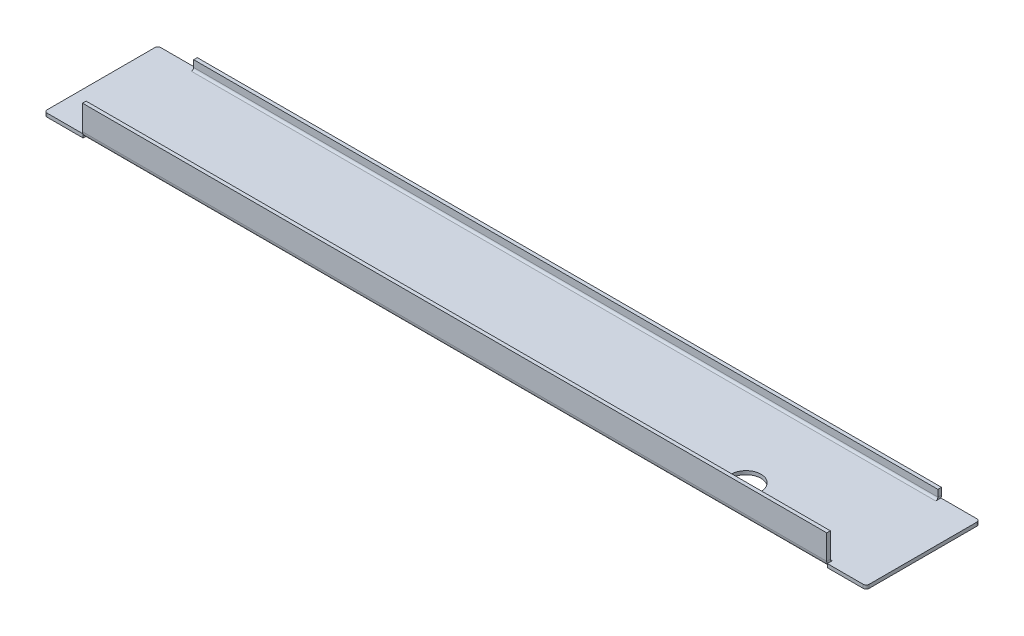
ISO-10303-21;
HEADER;
FILE_DESCRIPTION(('STEP AP214'),'2;1');
FILE_NAME('part.step','',(''),(''),'','','');
FILE_SCHEMA(('AUTOMOTIVE_DESIGN { 1 0 10303 214 1 1 1 1 }'));
ENDSEC;
DATA;
#1=APPLICATION_CONTEXT('core data for automotive mechanical design processes');
#2=APPLICATION_PROTOCOL_DEFINITION('international standard','automotive_design',2000,#1);
#3=PRODUCT_CONTEXT('',#1,'mechanical');
#4=PRODUCT('Part','Part','',(#3));
#5=PRODUCT_RELATED_PRODUCT_CATEGORY('part','',(#4));
#6=PRODUCT_DEFINITION_FORMATION('','',#4);
#7=PRODUCT_DEFINITION_CONTEXT('part definition',#1,'design');
#8=PRODUCT_DEFINITION('design','',#6,#7);
#9=PRODUCT_DEFINITION_SHAPE('','',#8);
#10=(LENGTH_UNIT() NAMED_UNIT(*) SI_UNIT(.MILLI.,.METRE.));
#11=(NAMED_UNIT(*) PLANE_ANGLE_UNIT() SI_UNIT($,.RADIAN.));
#12=(NAMED_UNIT(*) SI_UNIT($,.STERADIAN.) SOLID_ANGLE_UNIT());
#13=UNCERTAINTY_MEASURE_WITH_UNIT(LENGTH_MEASURE(1.E-05),#10,'distance_accuracy_value','');
#14=(GEOMETRIC_REPRESENTATION_CONTEXT(3) GLOBAL_UNCERTAINTY_ASSIGNED_CONTEXT((#13)) GLOBAL_UNIT_ASSIGNED_CONTEXT((#10,
#11,#12)) REPRESENTATION_CONTEXT('',''));
#15=CARTESIAN_POINT('',(0.,0.,0.));
#16=DIRECTION('',(0.,0.,1.));
#17=DIRECTION('',(1.,0.,0.));
#18=AXIS2_PLACEMENT_3D('',#15,#16,#17);
#19=CARTESIAN_POINT('',(-124.5,0.7366,17.2634));
#20=DIRECTION('',(-1.,0.,0.));
#21=DIRECTION('',(0.,0.,1.));
#22=AXIS2_PLACEMENT_3D('',#19,#20,#21);
#23=PLANE('',#22);
#24=CARTESIAN_POINT('',(-124.5,0.7366,17.2634));
#25=DIRECTION('',(1.,0.,0.));
#26=DIRECTION('',(0.,0.,-1.));
#27=AXIS2_PLACEMENT_3D('',#24,#25,#26);
#28=CIRCLE('',#27,0.7366);
#29=CARTESIAN_POINT('',(-124.5,0.7366,18.));
#30=VERTEX_POINT('',#29);
#31=CARTESIAN_POINT('',(-124.5,0.,17.2634));
#32=VERTEX_POINT('',#31);
#33=EDGE_CURVE('E301',#30,#32,#28,.T.);
#34=ORIENTED_EDGE('',*,*,#33,.T.);
#35=DIRECTION('',(0.,0.,-1.));
#36=VECTOR('',#35,1.);
#37=CARTESIAN_POINT('',(-124.5,0.,19.));
#38=LINE('',#37,#36);
#39=CARTESIAN_POINT('',(-124.5,0.,19.));
#40=VERTEX_POINT('',#39);
#41=EDGE_CURVE('E239',#40,#32,#38,.T.);
#42=ORIENTED_EDGE('',*,*,#41,.F.);
#43=DIRECTION('',(0.,1.,0.));
#44=VECTOR('',#43,1.);
#45=CARTESIAN_POINT('',(-124.5,-1.2,19.));
#46=LINE('',#45,#44);
#47=CARTESIAN_POINT('',(-124.5,-0.120511427995214,19.));
#48=VERTEX_POINT('',#47);
#49=EDGE_CURVE('E218',#48,#40,#46,.T.);
#50=ORIENTED_EDGE('',*,*,#49,.F.);
#51=CARTESIAN_POINT('',(-124.5,0.7366,17.2634));
#52=DIRECTION('',(-1.,0.,0.));
#53=DIRECTION('',(0.,0.,1.));
#54=AXIS2_PLACEMENT_3D('',#51,#52,#53);
#55=CIRCLE('',#54,1.9366);
#56=CARTESIAN_POINT('',(-124.5,0.736600000000001,19.2));
#57=VERTEX_POINT('',#56);
#58=EDGE_CURVE('E304',#57,#48,#55,.F.);
#59=ORIENTED_EDGE('',*,*,#58,.F.);
#60=DIRECTION('',(0.,0.,-1.));
#61=VECTOR('',#60,1.);
#62=CARTESIAN_POINT('',(-124.5,0.7366,18.));
#63=LINE('',#62,#61);
#64=EDGE_CURVE('E314',#30,#57,#63,.F.);
#65=ORIENTED_EDGE('',*,*,#64,.F.);
#66=EDGE_LOOP('',(#34,#42,#50,#59,#65));
#67=FACE_BOUND('',#66,.T.);
#68=ADVANCED_FACE('F34',(#67),#23,.T.);
#69=CARTESIAN_POINT('',(-124.5,0.7366,-17.2634));
#70=DIRECTION('',(-1.,0.,0.));
#71=DIRECTION('',(0.,0.,1.));
#72=AXIS2_PLACEMENT_3D('',#69,#70,#71);
#73=PLANE('',#72);
#74=DIRECTION('',(0.,1.,0.));
#75=VECTOR('',#74,1.);
#76=CARTESIAN_POINT('',(-124.5,0.7366,-19.));
#77=LINE('',#76,#75);
#78=CARTESIAN_POINT('',(-124.5,-0.120511427995214,-19.));
#79=VERTEX_POINT('',#78);
#80=CARTESIAN_POINT('',(-124.5,0.,-19.));
#81=VERTEX_POINT('',#80);
#82=EDGE_CURVE('E380',#79,#81,#77,.T.);
#83=ORIENTED_EDGE('',*,*,#82,.T.);
#84=DIRECTION('',(0.,0.,1.));
#85=VECTOR('',#84,1.);
#86=CARTESIAN_POINT('',(-124.5,0.,-17.2634));
#87=LINE('',#86,#85);
#88=CARTESIAN_POINT('',(-124.5,0.,-17.2634));
#89=VERTEX_POINT('',#88);
#90=EDGE_CURVE('E383',#81,#89,#87,.T.);
#91=ORIENTED_EDGE('',*,*,#90,.T.);
#92=CARTESIAN_POINT('',(-124.5,0.7366,-17.2634));
#93=DIRECTION('',(1.,0.,0.));
#94=DIRECTION('',(0.,0.,-1.));
#95=AXIS2_PLACEMENT_3D('',#92,#93,#94);
#96=CIRCLE('',#95,0.7366);
#97=CARTESIAN_POINT('',(-124.5,0.7366,-18.));
#98=VERTEX_POINT('',#97);
#99=EDGE_CURVE('E283',#89,#98,#96,.T.);
#100=ORIENTED_EDGE('',*,*,#99,.T.);
#101=DIRECTION('',(0.,0.,1.));
#102=VECTOR('',#101,1.);
#103=CARTESIAN_POINT('',(-124.5,0.7366,-18.));
#104=LINE('',#103,#102);
#105=CARTESIAN_POINT('',(-124.5,0.736599999999998,-19.2));
#106=VERTEX_POINT('',#105);
#107=EDGE_CURVE('E295',#98,#106,#104,.F.);
#108=ORIENTED_EDGE('',*,*,#107,.T.);
#109=CARTESIAN_POINT('',(-124.5,0.7366,-17.2634));
#110=DIRECTION('',(-1.,0.,0.));
#111=DIRECTION('',(0.,0.,1.));
#112=AXIS2_PLACEMENT_3D('',#109,#110,#111);
#113=CIRCLE('',#112,1.9366);
#114=EDGE_CURVE('E289',#79,#106,#113,.F.);
#115=ORIENTED_EDGE('',*,*,#114,.F.);
#116=EDGE_LOOP('',(#83,#91,#100,#108,#115));
#117=FACE_BOUND('',#116,.T.);
#118=ADVANCED_FACE('F437',(#117),#73,.T.);
#119=CARTESIAN_POINT('',(124.5,0.7366,17.2634));
#120=DIRECTION('',(1.,0.,0.));
#121=DIRECTION('',(0.,0.,-1.));
#122=AXIS2_PLACEMENT_3D('',#119,#120,#121);
#123=PLANE('',#122);
#124=DIRECTION('',(0.,-1.,0.));
#125=VECTOR('',#124,1.);
#126=CARTESIAN_POINT('',(124.5,0.,19.));
#127=LINE('',#126,#125);
#128=CARTESIAN_POINT('',(124.5,0.,19.));
#129=VERTEX_POINT('',#128);
#130=CARTESIAN_POINT('',(124.5,-0.120511427995214,19.));
#131=VERTEX_POINT('',#130);
#132=EDGE_CURVE('E250',#129,#131,#127,.T.);
#133=ORIENTED_EDGE('',*,*,#132,.F.);
#134=DIRECTION('',(0.,0.,-1.));
#135=VECTOR('',#134,1.);
#136=CARTESIAN_POINT('',(124.5,0.,19.));
#137=LINE('',#136,#135);
#138=CARTESIAN_POINT('',(124.5,0.,17.2634));
#139=VERTEX_POINT('',#138);
#140=EDGE_CURVE('E263',#129,#139,#137,.T.);
#141=ORIENTED_EDGE('',*,*,#140,.T.);
#142=CARTESIAN_POINT('',(124.5,0.7366,17.2634));
#143=DIRECTION('',(-1.,0.,0.));
#144=DIRECTION('',(0.,0.,1.));
#145=AXIS2_PLACEMENT_3D('',#142,#143,#144);
#146=CIRCLE('',#145,0.7366);
#147=CARTESIAN_POINT('',(124.5,0.7366,18.));
#148=VERTEX_POINT('',#147);
#149=EDGE_CURVE('E320',#139,#148,#146,.T.);
#150=ORIENTED_EDGE('',*,*,#149,.T.);
#151=DIRECTION('',(0.,0.,1.));
#152=VECTOR('',#151,1.);
#153=CARTESIAN_POINT('',(124.5,0.7366,19.2));
#154=LINE('',#153,#152);
#155=CARTESIAN_POINT('',(124.5,0.7366,19.2));
#156=VERTEX_POINT('',#155);
#157=EDGE_CURVE('E329',#156,#148,#154,.F.);
#158=ORIENTED_EDGE('',*,*,#157,.F.);
#159=CARTESIAN_POINT('',(124.5,0.7366,17.2634));
#160=DIRECTION('',(-1.,0.,0.));
#161=DIRECTION('',(0.,0.,1.));
#162=AXIS2_PLACEMENT_3D('',#159,#160,#161);
#163=CIRCLE('',#162,1.9366);
#164=EDGE_CURVE('E317',#131,#156,#163,.T.);
#165=ORIENTED_EDGE('',*,*,#164,.F.);
#166=EDGE_LOOP('',(#133,#141,#150,#158,#165));
#167=FACE_BOUND('',#166,.T.);
#168=ADVANCED_FACE('F443',(#167),#123,.T.);
#169=CARTESIAN_POINT('',(124.5,0.7366,-17.2634));
#170=DIRECTION('',(1.,0.,0.));
#171=DIRECTION('',(0.,0.,-1.));
#172=AXIS2_PLACEMENT_3D('',#169,#170,#171);
#173=PLANE('',#172);
#174=CARTESIAN_POINT('',(124.5,0.7366,-17.2634));
#175=DIRECTION('',(-1.,0.,0.));
#176=DIRECTION('',(0.,0.,1.));
#177=AXIS2_PLACEMENT_3D('',#174,#175,#176);
#178=CIRCLE('',#177,0.7366);
#179=CARTESIAN_POINT('',(124.5,0.736599999999999,-18.));
#180=VERTEX_POINT('',#179);
#181=CARTESIAN_POINT('',(124.5,0.,-17.2634));
#182=VERTEX_POINT('',#181);
#183=EDGE_CURVE('E269',#180,#182,#178,.T.);
#184=ORIENTED_EDGE('',*,*,#183,.T.);
#185=CARTESIAN_POINT('',(124.5,0.,-19.));
#186=VERTEX_POINT('',#185);
#187=EDGE_CURVE('E262',#182,#186,#137,.T.);
#188=ORIENTED_EDGE('',*,*,#187,.T.);
#189=DIRECTION('',(0.,-1.,0.));
#190=VECTOR('',#189,1.);
#191=CARTESIAN_POINT('',(124.5,0.,-19.));
#192=LINE('',#191,#190);
#193=CARTESIAN_POINT('',(124.5,-0.120511427995214,-19.));
#194=VERTEX_POINT('',#193);
#195=EDGE_CURVE('E247',#186,#194,#192,.T.);
#196=ORIENTED_EDGE('',*,*,#195,.T.);
#197=CARTESIAN_POINT('',(124.5,0.7366,-17.2634));
#198=DIRECTION('',(-1.,0.,0.));
#199=DIRECTION('',(0.,0.,1.));
#200=AXIS2_PLACEMENT_3D('',#197,#198,#199);
#201=CIRCLE('',#200,1.9366);
#202=CARTESIAN_POINT('',(124.5,0.736599999999998,-19.2));
#203=VERTEX_POINT('',#202);
#204=EDGE_CURVE('E268',#203,#194,#201,.T.);
#205=ORIENTED_EDGE('',*,*,#204,.F.);
#206=DIRECTION('',(0.,0.,-1.));
#207=VECTOR('',#206,1.);
#208=CARTESIAN_POINT('',(124.5,0.736599999999998,-19.2));
#209=LINE('',#208,#207);
#210=EDGE_CURVE('E280',#203,#180,#209,.F.);
#211=ORIENTED_EDGE('',*,*,#210,.T.);
#212=EDGE_LOOP('',(#184,#188,#196,#205,#211));
#213=FACE_BOUND('',#212,.T.);
#214=ADVANCED_FACE('F456',(#213),#173,.T.);
#215=CARTESIAN_POINT('',(137.5,0.,-19.2));
#216=DIRECTION('',(0.,0.,1.));
#217=DIRECTION('',(0.,-1.,0.));
#218=AXIS2_PLACEMENT_3D('',#215,#216,#217);
#219=PLANE('',#218);
#220=DIRECTION('',(0.,-1.,0.));
#221=VECTOR('',#220,1.);
#222=CARTESIAN_POINT('',(124.5,0.,-19.2));
#223=LINE('',#222,#221);
#224=CARTESIAN_POINT('',(124.5,3.,-19.2));
#225=VERTEX_POINT('',#224);
#226=EDGE_CURVE('E272',#225,#203,#223,.T.);
#227=ORIENTED_EDGE('',*,*,#226,.T.);
#228=DIRECTION('',(-1.,0.,0.));
#229=VECTOR('',#228,1.);
#230=CARTESIAN_POINT('',(137.5,0.736599999999998,-19.2));
#231=LINE('',#230,#229);
#232=EDGE_CURVE('E345',#203,#106,#231,.T.);
#233=ORIENTED_EDGE('',*,*,#232,.T.);
#234=DIRECTION('',(0.,-1.,0.));
#235=VECTOR('',#234,1.);
#236=CARTESIAN_POINT('',(-124.5,0.,-19.2));
#237=LINE('',#236,#235);
#238=CARTESIAN_POINT('',(-124.5,3.,-19.2));
#239=VERTEX_POINT('',#238);
#240=EDGE_CURVE('E292',#106,#239,#237,.F.);
#241=ORIENTED_EDGE('',*,*,#240,.T.);
#242=DIRECTION('',(-1.,0.,0.));
#243=VECTOR('',#242,1.);
#244=CARTESIAN_POINT('',(137.5,3.,-19.2));
#245=LINE('',#244,#243);
#246=EDGE_CURVE('E378',#225,#239,#245,.T.);
#247=ORIENTED_EDGE('',*,*,#246,.F.);
#248=EDGE_LOOP('',(#227,#233,#241,#247));
#249=FACE_BOUND('',#248,.T.);
#250=ADVANCED_FACE('F503',(#249),#219,.F.);
#251=CARTESIAN_POINT('',(137.5,3.,-18.));
#252=DIRECTION('',(0.,1.,0.));
#253=DIRECTION('',(0.,0.,1.));
#254=AXIS2_PLACEMENT_3D('',#251,#252,#253);
#255=PLANE('',#254);
#256=DIRECTION('',(-1.,0.,0.));
#257=VECTOR('',#256,1.);
#258=CARTESIAN_POINT('',(137.5,3.,-18.));
#259=LINE('',#258,#257);
#260=CARTESIAN_POINT('',(124.5,3.,-18.));
#261=VERTEX_POINT('',#260);
#262=CARTESIAN_POINT('',(-124.5,3.,-18.));
#263=VERTEX_POINT('',#262);
#264=EDGE_CURVE('E376',#261,#263,#259,.T.);
#265=ORIENTED_EDGE('',*,*,#264,.F.);
#266=DIRECTION('',(0.,0.,-1.));
#267=VECTOR('',#266,1.);
#268=CARTESIAN_POINT('',(124.5,3.,-19.2));
#269=LINE('',#268,#267);
#270=EDGE_CURVE('E277',#225,#261,#269,.F.);
#271=ORIENTED_EDGE('',*,*,#270,.F.);
#272=ORIENTED_EDGE('',*,*,#246,.T.);
#273=DIRECTION('',(0.,0.,1.));
#274=VECTOR('',#273,1.);
#275=CARTESIAN_POINT('',(-124.5,3.,-18.));
#276=LINE('',#275,#274);
#277=EDGE_CURVE('E298',#263,#239,#276,.F.);
#278=ORIENTED_EDGE('',*,*,#277,.F.);
#279=EDGE_LOOP('',(#265,#271,#272,#278));
#280=FACE_BOUND('',#279,.T.);
#281=ADVANCED_FACE('F499',(#280),#255,.T.);
#282=CARTESIAN_POINT('',(137.5,0.,-18.));
#283=DIRECTION('',(0.,0.,1.));
#284=DIRECTION('',(0.,-1.,0.));
#285=AXIS2_PLACEMENT_3D('',#282,#283,#284);
#286=PLANE('',#285);
#287=DIRECTION('',(-1.,0.,0.));
#288=VECTOR('',#287,1.);
#289=CARTESIAN_POINT('',(137.5,0.736599999999999,-18.));
#290=LINE('',#289,#288);
#291=EDGE_CURVE('E374',#180,#98,#290,.T.);
#292=ORIENTED_EDGE('',*,*,#291,.F.);
#293=DIRECTION('',(0.,-1.,0.));
#294=VECTOR('',#293,1.);
#295=CARTESIAN_POINT('',(124.5,0.,-18.));
#296=LINE('',#295,#294);
#297=EDGE_CURVE('E275',#261,#180,#296,.T.);
#298=ORIENTED_EDGE('',*,*,#297,.F.);
#299=ORIENTED_EDGE('',*,*,#264,.T.);
#300=DIRECTION('',(0.,1.,0.));
#301=VECTOR('',#300,1.);
#302=CARTESIAN_POINT('',(-124.5,0.,-18.));
#303=LINE('',#302,#301);
#304=EDGE_CURVE('E288',#98,#263,#303,.T.);
#305=ORIENTED_EDGE('',*,*,#304,.F.);
#306=EDGE_LOOP('',(#292,#298,#299,#305));
#307=FACE_BOUND('',#306,.T.);
#308=ADVANCED_FACE('F495',(#307),#286,.T.);
#309=CARTESIAN_POINT('',(137.5,0.7366,-17.2634));
#310=DIRECTION('',(-1.,0.,0.));
#311=DIRECTION('',(0.,0.,1.));
#312=AXIS2_PLACEMENT_3D('',#309,#310,#311);
#313=CYLINDRICAL_SURFACE('',#312,0.7366);
#314=DIRECTION('',(-1.,0.,0.));
#315=VECTOR('',#314,1.);
#316=CARTESIAN_POINT('',(137.5,0.,-17.2634));
#317=LINE('',#316,#315);
#318=EDGE_CURVE('E371',#182,#89,#317,.T.);
#319=ORIENTED_EDGE('',*,*,#318,.F.);
#320=ORIENTED_EDGE('',*,*,#183,.F.);
#321=ORIENTED_EDGE('',*,*,#291,.T.);
#322=ORIENTED_EDGE('',*,*,#99,.F.);
#323=EDGE_LOOP('',(#319,#320,#321,#322));
#324=FACE_BOUND('',#323,.T.);
#325=ADVANCED_FACE('F465',(#324),#313,.F.);
#326=CARTESIAN_POINT('',(137.5,0.7366,-17.2634));
#327=DIRECTION('',(-1.,0.,0.));
#328=DIRECTION('',(0.,0.,1.));
#329=AXIS2_PLACEMENT_3D('',#326,#327,#328);
#330=CYLINDRICAL_SURFACE('',#329,1.9366);
#331=ORIENTED_EDGE('',*,*,#204,.T.);
#332=CARTESIAN_POINT('',(124.5,0.7366,-17.2634));
#333=DIRECTION('',(1.,0.,0.));
#334=DIRECTION('',(0.,0.,-1.));
#335=AXIS2_PLACEMENT_3D('',#332,#333,#334);
#336=CIRCLE('',#335,1.9366);
#337=CARTESIAN_POINT('',(124.5,-1.2,-17.2634));
#338=VERTEX_POINT('',#337);
#339=EDGE_CURVE('E266',#338,#194,#336,.T.);
#340=ORIENTED_EDGE('',*,*,#339,.F.);
#341=DIRECTION('',(-1.,0.,0.));
#342=VECTOR('',#341,1.);
#343=CARTESIAN_POINT('',(137.5,-1.2,-17.2634));
#344=LINE('',#343,#342);
#345=CARTESIAN_POINT('',(-124.5,-1.2,-17.2634));
#346=VERTEX_POINT('',#345);
#347=EDGE_CURVE('E352',#338,#346,#344,.T.);
#348=ORIENTED_EDGE('',*,*,#347,.T.);
#349=EDGE_CURVE('E285',#346,#79,#113,.F.);
#350=ORIENTED_EDGE('',*,*,#349,.T.);
#351=ORIENTED_EDGE('',*,*,#114,.T.);
#352=ORIENTED_EDGE('',*,*,#232,.F.);
#353=EDGE_LOOP('',(#331,#340,#348,#350,#351,#352));
#354=FACE_BOUND('',#353,.T.);
#355=ADVANCED_FACE('F461',(#354),#330,.T.);
#356=CARTESIAN_POINT('',(137.5,0.7366,17.2634));
#357=DIRECTION('',(-1.,0.,0.));
#358=DIRECTION('',(0.,0.,1.));
#359=AXIS2_PLACEMENT_3D('',#356,#357,#358);
#360=CYLINDRICAL_SURFACE('',#359,0.7366);
#361=DIRECTION('',(-1.,0.,0.));
#362=VECTOR('',#361,1.);
#363=CARTESIAN_POINT('',(137.5,0.,17.2634));
#364=LINE('',#363,#362);
#365=EDGE_CURVE('E368',#139,#32,#364,.T.);
#366=ORIENTED_EDGE('',*,*,#365,.T.);
#367=ORIENTED_EDGE('',*,*,#33,.F.);
#368=DIRECTION('',(-1.,0.,0.));
#369=VECTOR('',#368,1.);
#370=CARTESIAN_POINT('',(137.5,0.7366,18.));
#371=LINE('',#370,#369);
#372=EDGE_CURVE('E365',#148,#30,#371,.T.);
#373=ORIENTED_EDGE('',*,*,#372,.F.);
#374=ORIENTED_EDGE('',*,*,#149,.F.);
#375=EDGE_LOOP('',(#366,#367,#373,#374));
#376=FACE_BOUND('',#375,.T.);
#377=ADVANCED_FACE('F464',(#376),#360,.F.);
#378=CARTESIAN_POINT('',(137.5,9.,18.));
#379=DIRECTION('',(0.,0.,-1.));
#380=DIRECTION('',(-1.,0.,0.));
#381=AXIS2_PLACEMENT_3D('',#378,#379,#380);
#382=PLANE('',#381);
#383=ORIENTED_EDGE('',*,*,#372,.T.);
#384=DIRECTION('',(0.,-1.,0.));
#385=VECTOR('',#384,1.);
#386=CARTESIAN_POINT('',(-124.5,9.,18.));
#387=LINE('',#386,#385);
#388=CARTESIAN_POINT('',(-124.5,8.99999999999999,18.));
#389=VERTEX_POINT('',#388);
#390=EDGE_CURVE('E307',#389,#30,#387,.T.);
#391=ORIENTED_EDGE('',*,*,#390,.F.);
#392=DIRECTION('',(-1.,0.,0.));
#393=VECTOR('',#392,1.);
#394=CARTESIAN_POINT('',(137.5,9.,18.));
#395=LINE('',#394,#393);
#396=CARTESIAN_POINT('',(124.5,9.00000000000004,18.));
#397=VERTEX_POINT('',#396);
#398=EDGE_CURVE('E362',#397,#389,#395,.T.);
#399=ORIENTED_EDGE('',*,*,#398,.F.);
#400=DIRECTION('',(0.,1.,0.));
#401=VECTOR('',#400,1.);
#402=CARTESIAN_POINT('',(124.5,9.,18.));
#403=LINE('',#402,#401);
#404=EDGE_CURVE('E326',#397,#148,#403,.F.);
#405=ORIENTED_EDGE('',*,*,#404,.T.);
#406=EDGE_LOOP('',(#383,#391,#399,#405));
#407=FACE_BOUND('',#406,.T.);
#408=ADVANCED_FACE('F482',(#407),#382,.T.);
#409=CARTESIAN_POINT('',(137.5,9.,19.2));
#410=DIRECTION('',(0.,1.,0.));
#411=DIRECTION('',(0.,0.,1.));
#412=AXIS2_PLACEMENT_3D('',#409,#410,#411);
#413=PLANE('',#412);
#414=ORIENTED_EDGE('',*,*,#398,.T.);
#415=DIRECTION('',(0.,0.,-1.));
#416=VECTOR('',#415,1.);
#417=CARTESIAN_POINT('',(-124.5,8.99999999999999,18.));
#418=LINE('',#417,#416);
#419=CARTESIAN_POINT('',(-124.5,8.99999999999999,19.2));
#420=VERTEX_POINT('',#419);
#421=EDGE_CURVE('E312',#389,#420,#418,.F.);
#422=ORIENTED_EDGE('',*,*,#421,.T.);
#423=DIRECTION('',(-1.,0.,0.));
#424=VECTOR('',#423,1.);
#425=CARTESIAN_POINT('',(137.5,9.,19.2));
#426=LINE('',#425,#424);
#427=CARTESIAN_POINT('',(124.5,9.00000000000004,19.2));
#428=VERTEX_POINT('',#427);
#429=EDGE_CURVE('E359',#428,#420,#426,.T.);
#430=ORIENTED_EDGE('',*,*,#429,.F.);
#431=DIRECTION('',(0.,0.,1.));
#432=VECTOR('',#431,1.);
#433=CARTESIAN_POINT('',(124.5,9.00000000000004,19.2));
#434=LINE('',#433,#432);
#435=EDGE_CURVE('E332',#428,#397,#434,.F.);
#436=ORIENTED_EDGE('',*,*,#435,.T.);
#437=EDGE_LOOP('',(#414,#422,#430,#436));
#438=FACE_BOUND('',#437,.T.);
#439=ADVANCED_FACE('F478',(#438),#413,.T.);
#440=CARTESIAN_POINT('',(137.5,9.,19.2));
#441=DIRECTION('',(0.,0.,-1.));
#442=DIRECTION('',(-1.,0.,0.));
#443=AXIS2_PLACEMENT_3D('',#440,#441,#442);
#444=PLANE('',#443);
#445=DIRECTION('',(0.,1.,0.));
#446=VECTOR('',#445,1.);
#447=CARTESIAN_POINT('',(-124.5,9.,19.2));
#448=LINE('',#447,#446);
#449=EDGE_CURVE('E309',#420,#57,#448,.F.);
#450=ORIENTED_EDGE('',*,*,#449,.T.);
#451=DIRECTION('',(-1.,0.,0.));
#452=VECTOR('',#451,1.);
#453=CARTESIAN_POINT('',(137.5,0.7366,19.2));
#454=LINE('',#453,#452);
#455=EDGE_CURVE('E356',#156,#57,#454,.T.);
#456=ORIENTED_EDGE('',*,*,#455,.F.);
#457=DIRECTION('',(0.,-1.,0.));
#458=VECTOR('',#457,1.);
#459=CARTESIAN_POINT('',(124.5,0.,19.2));
#460=LINE('',#459,#458);
#461=EDGE_CURVE('E322',#428,#156,#460,.T.);
#462=ORIENTED_EDGE('',*,*,#461,.F.);
#463=ORIENTED_EDGE('',*,*,#429,.T.);
#464=EDGE_LOOP('',(#450,#456,#462,#463));
#465=FACE_BOUND('',#464,.T.);
#466=ADVANCED_FACE('F474',(#465),#444,.F.);
#467=CARTESIAN_POINT('',(137.5,0.7366,17.2634));
#468=DIRECTION('',(-1.,0.,0.));
#469=DIRECTION('',(0.,0.,1.));
#470=AXIS2_PLACEMENT_3D('',#467,#468,#469);
#471=CYLINDRICAL_SURFACE('',#470,1.9366);
#472=ORIENTED_EDGE('',*,*,#58,.T.);
#473=CARTESIAN_POINT('',(-124.5,0.7366,17.2634));
#474=DIRECTION('',(-1.,0.,0.));
#475=DIRECTION('',(0.,-1.,0.));
#476=AXIS2_PLACEMENT_3D('',#473,#474,#475);
#477=CIRCLE('',#476,1.9366);
#478=CARTESIAN_POINT('',(-124.5,-1.2,17.2634));
#479=VERTEX_POINT('',#478);
#480=EDGE_CURVE('E226',#479,#48,#477,.T.);
#481=ORIENTED_EDGE('',*,*,#480,.F.);
#482=DIRECTION('',(-1.,0.,0.));
#483=VECTOR('',#482,1.);
#484=CARTESIAN_POINT('',(137.5,-1.2,17.2634));
#485=LINE('',#484,#483);
#486=CARTESIAN_POINT('',(124.5,-1.2,17.2634));
#487=VERTEX_POINT('',#486);
#488=EDGE_CURVE('E233',#487,#479,#485,.T.);
#489=ORIENTED_EDGE('',*,*,#488,.F.);
#490=EDGE_CURVE('E323',#487,#131,#163,.T.);
#491=ORIENTED_EDGE('',*,*,#490,.T.);
#492=ORIENTED_EDGE('',*,*,#164,.T.);
#493=ORIENTED_EDGE('',*,*,#455,.T.);
#494=EDGE_LOOP('',(#472,#481,#489,#491,#492,#493));
#495=FACE_BOUND('',#494,.T.);
#496=ADVANCED_FACE('F470',(#495),#471,.T.);
#497=CARTESIAN_POINT('',(137.5,0.7366,19.2));
#498=DIRECTION('',(1.,0.,0.));
#499=DIRECTION('',(0.,0.,-1.));
#500=AXIS2_PLACEMENT_3D('',#497,#498,#499);
#501=PLANE('',#500);
#502=DIRECTION('',(0.,0.,-1.));
#503=VECTOR('',#502,1.);
#504=CARTESIAN_POINT('',(137.5,0.,18.));
#505=LINE('',#504,#503);
#506=CARTESIAN_POINT('',(137.5,0.,18.));
#507=VERTEX_POINT('',#506);
#508=CARTESIAN_POINT('',(137.5,0.,-18.));
#509=VERTEX_POINT('',#508);
#510=EDGE_CURVE('E338',#507,#509,#505,.T.);
#511=ORIENTED_EDGE('',*,*,#510,.F.);
#512=DIRECTION('',(0.,1.,0.));
#513=VECTOR('',#512,1.);
#514=CARTESIAN_POINT('',(137.5,0.7366,18.));
#515=LINE('',#514,#513);
#516=CARTESIAN_POINT('',(137.5,-1.2,18.));
#517=VERTEX_POINT('',#516);
#518=EDGE_CURVE('E399',#507,#517,#515,.F.);
#519=ORIENTED_EDGE('',*,*,#518,.T.);
#520=DIRECTION('',(0.,0.,-1.));
#521=VECTOR('',#520,1.);
#522=CARTESIAN_POINT('',(137.5,-1.2,18.));
#523=LINE('',#522,#521);
#524=CARTESIAN_POINT('',(137.5,-1.2,-18.));
#525=VERTEX_POINT('',#524);
#526=EDGE_CURVE('E341',#517,#525,#523,.T.);
#527=ORIENTED_EDGE('',*,*,#526,.T.);
#528=DIRECTION('',(0.,1.,0.));
#529=VECTOR('',#528,1.);
#530=CARTESIAN_POINT('',(137.5,0.,-18.));
#531=LINE('',#530,#529);
#532=EDGE_CURVE('E396',#525,#509,#531,.T.);
#533=ORIENTED_EDGE('',*,*,#532,.T.);
#534=EDGE_LOOP('',(#511,#519,#527,#533));
#535=FACE_BOUND('',#534,.T.);
#536=ADVANCED_FACE('F473',(#535),#501,.T.);
#537=CARTESIAN_POINT('',(-137.5,0.736599999999998,-19.2));
#538=DIRECTION('',(-1.,0.,0.));
#539=DIRECTION('',(0.,0.,1.));
#540=AXIS2_PLACEMENT_3D('',#537,#538,#539);
#541=PLANE('',#540);
#542=DIRECTION('',(0.,0.,-1.));
#543=VECTOR('',#542,1.);
#544=CARTESIAN_POINT('',(-137.5,-1.2,18.));
#545=LINE('',#544,#543);
#546=CARTESIAN_POINT('',(-137.5,-1.2,18.));
#547=VERTEX_POINT('',#546);
#548=CARTESIAN_POINT('',(-137.5,-1.2,-18.));
#549=VERTEX_POINT('',#548);
#550=EDGE_CURVE('E342',#547,#549,#545,.T.);
#551=ORIENTED_EDGE('',*,*,#550,.F.);
#552=DIRECTION('',(0.,-1.,0.));
#553=VECTOR('',#552,1.);
#554=CARTESIAN_POINT('',(-137.5,0.736599999999998,18.));
#555=LINE('',#554,#553);
#556=CARTESIAN_POINT('',(-137.5,0.,18.));
#557=VERTEX_POINT('',#556);
#558=EDGE_CURVE('E42',#547,#557,#555,.F.);
#559=ORIENTED_EDGE('',*,*,#558,.T.);
#560=DIRECTION('',(0.,0.,-1.));
#561=VECTOR('',#560,1.);
#562=CARTESIAN_POINT('',(-137.5,0.,18.));
#563=LINE('',#562,#561);
#564=CARTESIAN_POINT('',(-137.5,0.,-18.));
#565=VERTEX_POINT('',#564);
#566=EDGE_CURVE('E335',#557,#565,#563,.T.);
#567=ORIENTED_EDGE('',*,*,#566,.T.);
#568=DIRECTION('',(0.,-1.,0.));
#569=VECTOR('',#568,1.);
#570=CARTESIAN_POINT('',(-137.5,-1.2,-18.));
#571=LINE('',#570,#569);
#572=EDGE_CURVE('E410',#565,#549,#571,.T.);
#573=ORIENTED_EDGE('',*,*,#572,.T.);
#574=EDGE_LOOP('',(#551,#559,#567,#573));
#575=FACE_BOUND('',#574,.T.);
#576=ADVANCED_FACE('F415',(#575),#541,.T.);
#577=CARTESIAN_POINT('',(137.5,0.,18.));
#578=DIRECTION('',(0.,1.,0.));
#579=DIRECTION('',(0.,0.,1.));
#580=AXIS2_PLACEMENT_3D('',#577,#578,#579);
#581=PLANE('',#580);
#582=CARTESIAN_POINT('',(87.5,0.,9.2));
#583=DIRECTION('',(0.,1.,0.));
#584=DIRECTION('',(0.,0.,1.));
#585=AXIS2_PLACEMENT_3D('',#582,#583,#584);
#586=CIRCLE('',#585,5.);
#587=CARTESIAN_POINT('',(87.5,0.,14.2));
#588=VERTEX_POINT('',#587);
#589=EDGE_CURVE('E546',#588,#588,#586,.T.);
#590=ORIENTED_EDGE('',*,*,#589,.F.);
#591=EDGE_LOOP('',(#590));
#592=FACE_BOUND('',#591,.T.);
#593=DIRECTION('',(-1.,0.,0.));
#594=VECTOR('',#593,1.);
#595=CARTESIAN_POINT('',(137.5,0.,19.));
#596=LINE('',#595,#594);
#597=CARTESIAN_POINT('',(136.5,0.,19.));
#598=VERTEX_POINT('',#597);
#599=EDGE_CURVE('E246',#598,#129,#596,.T.);
#600=ORIENTED_EDGE('',*,*,#599,.F.);
#601=CARTESIAN_POINT('',(136.5,0.,18.));
#602=DIRECTION('',(0.,1.,0.));
#603=DIRECTION('',(0.,0.,1.));
#604=AXIS2_PLACEMENT_3D('',#601,#602,#603);
#605=CIRCLE('',#604,1.);
#606=EDGE_CURVE('E394',#598,#507,#605,.T.);
#607=ORIENTED_EDGE('',*,*,#606,.T.);
#608=ORIENTED_EDGE('',*,*,#510,.T.);
#609=CARTESIAN_POINT('',(136.5,0.,-18.));
#610=DIRECTION('',(0.,1.,0.));
#611=DIRECTION('',(0.,0.,1.));
#612=AXIS2_PLACEMENT_3D('',#609,#610,#611);
#613=CIRCLE('',#612,1.);
#614=CARTESIAN_POINT('',(136.5,0.,-19.));
#615=VERTEX_POINT('',#614);
#616=EDGE_CURVE('E392',#509,#615,#613,.T.);
#617=ORIENTED_EDGE('',*,*,#616,.T.);
#618=DIRECTION('',(-1.,0.,0.));
#619=VECTOR('',#618,1.);
#620=CARTESIAN_POINT('',(137.5,0.,-19.));
#621=LINE('',#620,#619);
#622=EDGE_CURVE('E255',#615,#186,#621,.T.);
#623=ORIENTED_EDGE('',*,*,#622,.T.);
#624=ORIENTED_EDGE('',*,*,#187,.F.);
#625=ORIENTED_EDGE('',*,*,#318,.T.);
#626=ORIENTED_EDGE('',*,*,#90,.F.);
#627=DIRECTION('',(-1.,0.,0.));
#628=VECTOR('',#627,1.);
#629=CARTESIAN_POINT('',(-124.5,0.,-19.));
#630=LINE('',#629,#628);
#631=CARTESIAN_POINT('',(-136.5,0.,-19.));
#632=VERTEX_POINT('',#631);
#633=EDGE_CURVE('E219',#81,#632,#630,.T.);
#634=ORIENTED_EDGE('',*,*,#633,.T.);
#635=CARTESIAN_POINT('',(-136.5,0.,-18.));
#636=DIRECTION('',(0.,1.,0.));
#637=DIRECTION('',(0.,0.,1.));
#638=AXIS2_PLACEMENT_3D('',#635,#636,#637);
#639=CIRCLE('',#638,1.);
#640=EDGE_CURVE('E388',#632,#565,#639,.T.);
#641=ORIENTED_EDGE('',*,*,#640,.T.);
#642=ORIENTED_EDGE('',*,*,#566,.F.);
#643=CARTESIAN_POINT('',(-136.5,0.,18.));
#644=DIRECTION('',(0.,1.,0.));
#645=DIRECTION('',(0.,0.,1.));
#646=AXIS2_PLACEMENT_3D('',#643,#644,#645);
#647=CIRCLE('',#646,1.);
#648=CARTESIAN_POINT('',(-136.5,0.,19.));
#649=VERTEX_POINT('',#648);
#650=EDGE_CURVE('E390',#557,#649,#647,.T.);
#651=ORIENTED_EDGE('',*,*,#650,.T.);
#652=DIRECTION('',(-1.,0.,0.));
#653=VECTOR('',#652,1.);
#654=CARTESIAN_POINT('',(-124.5,0.,19.));
#655=LINE('',#654,#653);
#656=EDGE_CURVE('E227',#40,#649,#655,.T.);
#657=ORIENTED_EDGE('',*,*,#656,.F.);
#658=ORIENTED_EDGE('',*,*,#41,.T.);
#659=ORIENTED_EDGE('',*,*,#365,.F.);
#660=ORIENTED_EDGE('',*,*,#140,.F.);
#661=EDGE_LOOP('',(#600,#607,#608,#617,#623,#624,#625,#626,#634,#641,#642,#651,#657,#658,#659,#660));
#662=FACE_BOUND('',#661,.T.);
#663=ADVANCED_FACE('F420',(#592,#662),#581,.T.);
#664=CARTESIAN_POINT('',(137.5,-1.2,18.));
#665=DIRECTION('',(0.,1.,0.));
#666=DIRECTION('',(0.,0.,1.));
#667=AXIS2_PLACEMENT_3D('',#664,#665,#666);
#668=PLANE('',#667);
#669=CARTESIAN_POINT('',(87.5,-1.2,9.2));
#670=DIRECTION('',(0.,-1.,0.));
#671=DIRECTION('',(0.,0.,-1.));
#672=AXIS2_PLACEMENT_3D('',#669,#670,#671);
#673=CIRCLE('',#672,5.);
#674=CARTESIAN_POINT('',(87.5,-1.2,4.19999999999999));
#675=VERTEX_POINT('',#674);
#676=EDGE_CURVE('E782',#675,#675,#673,.T.);
#677=ORIENTED_EDGE('',*,*,#676,.F.);
#678=EDGE_LOOP('',(#677));
#679=FACE_BOUND('',#678,.T.);
#680=ORIENTED_EDGE('',*,*,#526,.F.);
#681=CARTESIAN_POINT('',(136.5,-1.2,18.));
#682=DIRECTION('',(0.,1.,0.));
#683=DIRECTION('',(0.,0.,1.));
#684=AXIS2_PLACEMENT_3D('',#681,#682,#683);
#685=CIRCLE('',#684,1.);
#686=CARTESIAN_POINT('',(136.5,-1.2,19.));
#687=VERTEX_POINT('',#686);
#688=EDGE_CURVE('E406',#517,#687,#685,.F.);
#689=ORIENTED_EDGE('',*,*,#688,.T.);
#690=DIRECTION('',(1.,0.,0.));
#691=VECTOR('',#690,1.);
#692=CARTESIAN_POINT('',(124.5,-1.2,19.));
#693=LINE('',#692,#691);
#694=CARTESIAN_POINT('',(124.5,-1.2,19.));
#695=VERTEX_POINT('',#694);
#696=EDGE_CURVE('E243',#695,#687,#693,.T.);
#697=ORIENTED_EDGE('',*,*,#696,.F.);
#698=DIRECTION('',(0.,0.,-1.));
#699=VECTOR('',#698,1.);
#700=CARTESIAN_POINT('',(124.5,-1.2,19.));
#701=LINE('',#700,#699);
#702=EDGE_CURVE('E260',#695,#487,#701,.T.);
#703=ORIENTED_EDGE('',*,*,#702,.T.);
#704=ORIENTED_EDGE('',*,*,#488,.T.);
#705=DIRECTION('',(0.,0.,-1.));
#706=VECTOR('',#705,1.);
#707=CARTESIAN_POINT('',(-124.5,-1.2,19.));
#708=LINE('',#707,#706);
#709=CARTESIAN_POINT('',(-124.5,-1.2,19.));
#710=VERTEX_POINT('',#709);
#711=EDGE_CURVE('E225',#710,#479,#708,.T.);
#712=ORIENTED_EDGE('',*,*,#711,.F.);
#713=DIRECTION('',(1.,0.,0.));
#714=VECTOR('',#713,1.);
#715=CARTESIAN_POINT('',(-137.5,-1.2,19.));
#716=LINE('',#715,#714);
#717=CARTESIAN_POINT('',(-136.5,-1.2,19.));
#718=VERTEX_POINT('',#717);
#719=EDGE_CURVE('E209',#718,#710,#716,.T.);
#720=ORIENTED_EDGE('',*,*,#719,.F.);
#721=CARTESIAN_POINT('',(-136.5,-1.2,18.));
#722=DIRECTION('',(0.,1.,0.));
#723=DIRECTION('',(0.,0.,1.));
#724=AXIS2_PLACEMENT_3D('',#721,#722,#723);
#725=CIRCLE('',#724,1.);
#726=EDGE_CURVE('E49',#718,#547,#725,.F.);
#727=ORIENTED_EDGE('',*,*,#726,.T.);
#728=ORIENTED_EDGE('',*,*,#550,.T.);
#729=CARTESIAN_POINT('',(-136.5,-1.2,-18.));
#730=DIRECTION('',(0.,1.,0.));
#731=DIRECTION('',(0.,0.,1.));
#732=AXIS2_PLACEMENT_3D('',#729,#730,#731);
#733=CIRCLE('',#732,1.);
#734=CARTESIAN_POINT('',(-136.5,-1.2,-19.));
#735=VERTEX_POINT('',#734);
#736=EDGE_CURVE('E401',#549,#735,#733,.F.);
#737=ORIENTED_EDGE('',*,*,#736,.T.);
#738=DIRECTION('',(1.,0.,0.));
#739=VECTOR('',#738,1.);
#740=CARTESIAN_POINT('',(-137.5,-1.2,-19.));
#741=LINE('',#740,#739);
#742=CARTESIAN_POINT('',(-124.5,-1.2,-19.));
#743=VERTEX_POINT('',#742);
#744=EDGE_CURVE('E543',#735,#743,#741,.T.);
#745=ORIENTED_EDGE('',*,*,#744,.T.);
#746=EDGE_CURVE('E234',#346,#743,#708,.T.);
#747=ORIENTED_EDGE('',*,*,#746,.F.);
#748=ORIENTED_EDGE('',*,*,#347,.F.);
#749=CARTESIAN_POINT('',(124.5,-1.2,-19.));
#750=VERTEX_POINT('',#749);
#751=EDGE_CURVE('E253',#338,#750,#701,.T.);
#752=ORIENTED_EDGE('',*,*,#751,.T.);
#753=DIRECTION('',(1.,0.,0.));
#754=VECTOR('',#753,1.);
#755=CARTESIAN_POINT('',(124.5,-1.2,-19.));
#756=LINE('',#755,#754);
#757=CARTESIAN_POINT('',(136.5,-1.2,-19.));
#758=VERTEX_POINT('',#757);
#759=EDGE_CURVE('E236',#750,#758,#756,.T.);
#760=ORIENTED_EDGE('',*,*,#759,.T.);
#761=CARTESIAN_POINT('',(136.5,-1.2,-18.));
#762=DIRECTION('',(0.,1.,0.));
#763=DIRECTION('',(0.,0.,1.));
#764=AXIS2_PLACEMENT_3D('',#761,#762,#763);
#765=CIRCLE('',#764,1.);
#766=EDGE_CURVE('E404',#758,#525,#765,.F.);
#767=ORIENTED_EDGE('',*,*,#766,.T.);
#768=EDGE_LOOP('',(#680,#689,#697,#703,#704,#712,#720,#727,#728,#737,#745,#747,#748,#752,#760,#767));
#769=FACE_BOUND('',#768,.T.);
#770=ADVANCED_FACE('F231',(#679,#769),#668,.F.);
#771=CARTESIAN_POINT('',(124.5,0.,19.2));
#772=DIRECTION('',(1.,0.,0.));
#773=DIRECTION('',(0.,-1.,0.));
#774=AXIS2_PLACEMENT_3D('',#771,#772,#773);
#775=PLANE('',#774);
#776=ORIENTED_EDGE('',*,*,#435,.F.);
#777=ORIENTED_EDGE('',*,*,#461,.T.);
#778=ORIENTED_EDGE('',*,*,#157,.T.);
#779=ORIENTED_EDGE('',*,*,#404,.F.);
#780=EDGE_LOOP('',(#776,#777,#778,#779));
#781=FACE_BOUND('',#780,.T.);
#782=ADVANCED_FACE('F452',(#781),#775,.T.);
#783=CARTESIAN_POINT('',(-124.5,9.,18.));
#784=DIRECTION('',(1.,0.,0.));
#785=DIRECTION('',(0.,-1.,0.));
#786=AXIS2_PLACEMENT_3D('',#783,#784,#785);
#787=PLANE('',#786);
#788=ORIENTED_EDGE('',*,*,#390,.T.);
#789=ORIENTED_EDGE('',*,*,#64,.T.);
#790=ORIENTED_EDGE('',*,*,#449,.F.);
#791=ORIENTED_EDGE('',*,*,#421,.F.);
#792=EDGE_LOOP('',(#788,#789,#790,#791));
#793=FACE_BOUND('',#792,.T.);
#794=ADVANCED_FACE('F449',(#793),#787,.F.);
#795=CARTESIAN_POINT('',(-124.5,0.,-18.));
#796=DIRECTION('',(1.,0.,0.));
#797=DIRECTION('',(0.,1.,0.));
#798=AXIS2_PLACEMENT_3D('',#795,#796,#797);
#799=PLANE('',#798);
#800=ORIENTED_EDGE('',*,*,#304,.T.);
#801=ORIENTED_EDGE('',*,*,#277,.T.);
#802=ORIENTED_EDGE('',*,*,#240,.F.);
#803=ORIENTED_EDGE('',*,*,#107,.F.);
#804=EDGE_LOOP('',(#800,#801,#802,#803));
#805=FACE_BOUND('',#804,.T.);
#806=ADVANCED_FACE('F448',(#805),#799,.F.);
#807=CARTESIAN_POINT('',(124.5,0.,-19.2));
#808=DIRECTION('',(-1.,0.,0.));
#809=DIRECTION('',(0.,-1.,0.));
#810=AXIS2_PLACEMENT_3D('',#807,#808,#809);
#811=PLANE('',#810);
#812=ORIENTED_EDGE('',*,*,#210,.F.);
#813=ORIENTED_EDGE('',*,*,#226,.F.);
#814=ORIENTED_EDGE('',*,*,#270,.T.);
#815=ORIENTED_EDGE('',*,*,#297,.T.);
#816=EDGE_LOOP('',(#812,#813,#814,#815));
#817=FACE_BOUND('',#816,.T.);
#818=ADVANCED_FACE('F571',(#817),#811,.F.);
#819=CARTESIAN_POINT('',(137.5,-1.2,-19.));
#820=DIRECTION('',(0.,0.,1.));
#821=DIRECTION('',(1.,0.,0.));
#822=AXIS2_PLACEMENT_3D('',#819,#820,#821);
#823=PLANE('',#822);
#824=ORIENTED_EDGE('',*,*,#622,.F.);
#825=DIRECTION('',(0.,1.,0.));
#826=VECTOR('',#825,1.);
#827=CARTESIAN_POINT('',(136.5,-1.2,-19.));
#828=LINE('',#827,#826);
#829=EDGE_CURVE('E57',#615,#758,#828,.F.);
#830=ORIENTED_EDGE('',*,*,#829,.T.);
#831=ORIENTED_EDGE('',*,*,#759,.F.);
#832=EDGE_CURVE('E257',#194,#750,#192,.T.);
#833=ORIENTED_EDGE('',*,*,#832,.F.);
#834=ORIENTED_EDGE('',*,*,#195,.F.);
#835=EDGE_LOOP('',(#824,#830,#831,#833,#834));
#836=FACE_BOUND('',#835,.T.);
#837=ADVANCED_FACE('F569',(#836),#823,.F.);
#838=CARTESIAN_POINT('',(124.5,0.,19.));
#839=DIRECTION('',(1.,0.,0.));
#840=DIRECTION('',(0.,0.,-1.));
#841=AXIS2_PLACEMENT_3D('',#838,#839,#840);
#842=PLANE('',#841);
#843=ORIENTED_EDGE('',*,*,#751,.F.);
#844=ORIENTED_EDGE('',*,*,#339,.T.);
#845=ORIENTED_EDGE('',*,*,#832,.T.);
#846=EDGE_LOOP('',(#843,#844,#845));
#847=FACE_BOUND('',#846,.T.);
#848=ADVANCED_FACE('F567',(#847),#842,.F.);
#849=EDGE_CURVE('E249',#131,#695,#127,.T.);
#850=ORIENTED_EDGE('',*,*,#849,.F.);
#851=ORIENTED_EDGE('',*,*,#490,.F.);
#852=ORIENTED_EDGE('',*,*,#702,.F.);
#853=EDGE_LOOP('',(#850,#851,#852));
#854=FACE_BOUND('',#853,.T.);
#855=ADVANCED_FACE('F530',(#854),#842,.F.);
#856=CARTESIAN_POINT('',(137.5,-1.2,19.));
#857=DIRECTION('',(0.,0.,1.));
#858=DIRECTION('',(1.,0.,0.));
#859=AXIS2_PLACEMENT_3D('',#856,#857,#858);
#860=PLANE('',#859);
#861=ORIENTED_EDGE('',*,*,#696,.T.);
#862=DIRECTION('',(0.,1.,0.));
#863=VECTOR('',#862,1.);
#864=CARTESIAN_POINT('',(136.5,-1.2,19.));
#865=LINE('',#864,#863);
#866=EDGE_CURVE('E385',#687,#598,#865,.T.);
#867=ORIENTED_EDGE('',*,*,#866,.T.);
#868=ORIENTED_EDGE('',*,*,#599,.T.);
#869=ORIENTED_EDGE('',*,*,#132,.T.);
#870=ORIENTED_EDGE('',*,*,#849,.T.);
#871=EDGE_LOOP('',(#861,#867,#868,#869,#870));
#872=FACE_BOUND('',#871,.T.);
#873=ADVANCED_FACE('F524',(#872),#860,.T.);
#874=CARTESIAN_POINT('',(-124.5,-1.2,-19.));
#875=DIRECTION('',(0.,0.,1.));
#876=DIRECTION('',(1.,0.,0.));
#877=AXIS2_PLACEMENT_3D('',#874,#875,#876);
#878=PLANE('',#877);
#879=ORIENTED_EDGE('',*,*,#744,.F.);
#880=DIRECTION('',(0.,-1.,0.));
#881=VECTOR('',#880,1.);
#882=CARTESIAN_POINT('',(-136.5,0.,-19.));
#883=LINE('',#882,#881);
#884=EDGE_CURVE('E11',#735,#632,#883,.F.);
#885=ORIENTED_EDGE('',*,*,#884,.T.);
#886=ORIENTED_EDGE('',*,*,#633,.F.);
#887=ORIENTED_EDGE('',*,*,#82,.F.);
#888=DIRECTION('',(0.,1.,0.));
#889=VECTOR('',#888,1.);
#890=CARTESIAN_POINT('',(-124.5,-1.2,-19.));
#891=LINE('',#890,#889);
#892=EDGE_CURVE('E545',#743,#79,#891,.T.);
#893=ORIENTED_EDGE('',*,*,#892,.F.);
#894=EDGE_LOOP('',(#879,#885,#886,#887,#893));
#895=FACE_BOUND('',#894,.T.);
#896=ADVANCED_FACE('F554',(#895),#878,.F.);
#897=CARTESIAN_POINT('',(-124.5,-1.2,19.));
#898=DIRECTION('',(-1.,0.,0.));
#899=DIRECTION('',(0.,-1.,0.));
#900=AXIS2_PLACEMENT_3D('',#897,#898,#899);
#901=PLANE('',#900);
#902=ORIENTED_EDGE('',*,*,#892,.T.);
#903=ORIENTED_EDGE('',*,*,#349,.F.);
#904=ORIENTED_EDGE('',*,*,#746,.T.);
#905=EDGE_LOOP('',(#902,#903,#904));
#906=FACE_BOUND('',#905,.T.);
#907=ADVANCED_FACE('F557',(#906),#901,.F.);
#908=ORIENTED_EDGE('',*,*,#711,.T.);
#909=ORIENTED_EDGE('',*,*,#480,.T.);
#910=EDGE_CURVE('E214',#710,#48,#46,.T.);
#911=ORIENTED_EDGE('',*,*,#910,.F.);
#912=EDGE_LOOP('',(#908,#909,#911));
#913=FACE_BOUND('',#912,.T.);
#914=ADVANCED_FACE('F224',(#913),#901,.F.);
#915=CARTESIAN_POINT('',(-124.5,-1.2,19.));
#916=DIRECTION('',(0.,0.,1.));
#917=DIRECTION('',(1.,0.,0.));
#918=AXIS2_PLACEMENT_3D('',#915,#916,#917);
#919=PLANE('',#918);
#920=ORIENTED_EDGE('',*,*,#656,.T.);
#921=DIRECTION('',(0.,-1.,0.));
#922=VECTOR('',#921,1.);
#923=CARTESIAN_POINT('',(-136.5,-1.2,19.));
#924=LINE('',#923,#922);
#925=EDGE_CURVE('E215',#649,#718,#924,.T.);
#926=ORIENTED_EDGE('',*,*,#925,.T.);
#927=ORIENTED_EDGE('',*,*,#719,.T.);
#928=ORIENTED_EDGE('',*,*,#910,.T.);
#929=ORIENTED_EDGE('',*,*,#49,.T.);
#930=EDGE_LOOP('',(#920,#926,#927,#928,#929));
#931=FACE_BOUND('',#930,.T.);
#932=ADVANCED_FACE('F212',(#931),#919,.T.);
#933=CARTESIAN_POINT('',(136.5,-1.2,18.));
#934=DIRECTION('',(0.,1.,0.));
#935=DIRECTION('',(0.,0.,1.));
#936=AXIS2_PLACEMENT_3D('',#933,#934,#935);
#937=CYLINDRICAL_SURFACE('',#936,1.);
#938=ORIENTED_EDGE('',*,*,#688,.F.);
#939=ORIENTED_EDGE('',*,*,#518,.F.);
#940=ORIENTED_EDGE('',*,*,#606,.F.);
#941=ORIENTED_EDGE('',*,*,#866,.F.);
#942=EDGE_LOOP('',(#938,#939,#940,#941));
#943=FACE_BOUND('',#942,.T.);
#944=ADVANCED_FACE('F433',(#943),#937,.T.);
#945=CARTESIAN_POINT('',(136.5,0.7366,-18.));
#946=DIRECTION('',(0.,-1.,0.));
#947=DIRECTION('',(0.,0.,-1.));
#948=AXIS2_PLACEMENT_3D('',#945,#946,#947);
#949=CYLINDRICAL_SURFACE('',#948,1.);
#950=ORIENTED_EDGE('',*,*,#766,.F.);
#951=ORIENTED_EDGE('',*,*,#829,.F.);
#952=ORIENTED_EDGE('',*,*,#616,.F.);
#953=ORIENTED_EDGE('',*,*,#532,.F.);
#954=EDGE_LOOP('',(#950,#951,#952,#953));
#955=FACE_BOUND('',#954,.T.);
#956=ADVANCED_FACE('F426',(#955),#949,.T.);
#957=CARTESIAN_POINT('',(-136.5,-1.2,18.));
#958=DIRECTION('',(0.,-1.,0.));
#959=DIRECTION('',(0.,0.,-1.));
#960=AXIS2_PLACEMENT_3D('',#957,#958,#959);
#961=CYLINDRICAL_SURFACE('',#960,1.);
#962=ORIENTED_EDGE('',*,*,#650,.F.);
#963=ORIENTED_EDGE('',*,*,#558,.F.);
#964=ORIENTED_EDGE('',*,*,#726,.F.);
#965=ORIENTED_EDGE('',*,*,#925,.F.);
#966=EDGE_LOOP('',(#962,#963,#964,#965));
#967=FACE_BOUND('',#966,.T.);
#968=ADVANCED_FACE('F424',(#967),#961,.T.);
#969=CARTESIAN_POINT('',(-136.5,0.736599999999998,-18.));
#970=DIRECTION('',(0.,1.,0.));
#971=DIRECTION('',(0.,0.,1.));
#972=AXIS2_PLACEMENT_3D('',#969,#970,#971);
#973=CYLINDRICAL_SURFACE('',#972,1.);
#974=ORIENTED_EDGE('',*,*,#640,.F.);
#975=ORIENTED_EDGE('',*,*,#884,.F.);
#976=ORIENTED_EDGE('',*,*,#736,.F.);
#977=ORIENTED_EDGE('',*,*,#572,.F.);
#978=EDGE_LOOP('',(#974,#975,#976,#977));
#979=FACE_BOUND('',#978,.T.);
#980=ADVANCED_FACE('F36',(#979),#973,.T.);
#981=CARTESIAN_POINT('',(87.5,9.00000000000004,9.2));
#982=DIRECTION('',(0.,-1.,0.));
#983=DIRECTION('',(0.,0.,-1.));
#984=AXIS2_PLACEMENT_3D('',#981,#982,#983);
#985=CYLINDRICAL_SURFACE('',#984,5.);
#986=ORIENTED_EDGE('',*,*,#589,.T.);
#987=EDGE_LOOP('',(#986));
#988=FACE_BOUND('',#987,.T.);
#989=ORIENTED_EDGE('',*,*,#676,.T.);
#990=EDGE_LOOP('',(#989));
#991=FACE_BOUND('',#990,.T.);
#992=ADVANCED_FACE('F431',(#988,#991),#985,.F.);
#993=CLOSED_SHELL('',(#68,#118,#168,#214,#250,#281,#308,#325,#355,#377,#408,#439,#466,#496,#536,
#576,#663,#770,#782,#794,#806,#818,#837,#848,#855,#873,#896,#907,#914,#932,#944,#956,#968,#980,#992));
#994=MANIFOLD_SOLID_BREP('B2',#993);
#995=ADVANCED_BREP_SHAPE_REPRESENTATION('',(#18,#994),#14);
#996=SHAPE_DEFINITION_REPRESENTATION(#9,#995);
ENDSEC;
END-ISO-10303-21;
